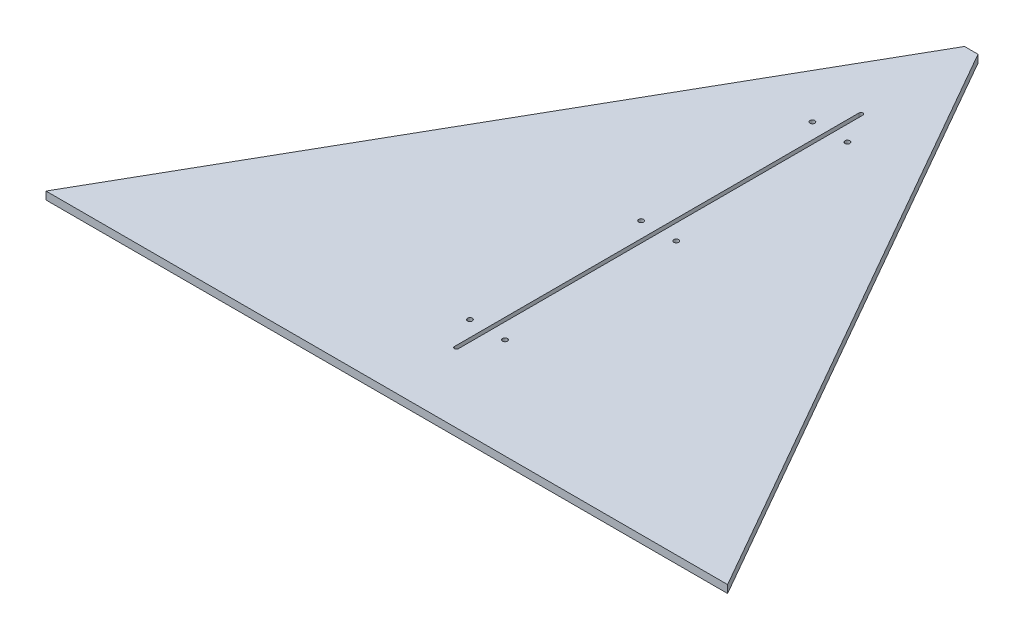
ISO-10303-21;
HEADER;
FILE_DESCRIPTION(('STEP AP214'),'2;1');
FILE_NAME('part.step','',(''),(''),'','','');
FILE_SCHEMA(('AUTOMOTIVE_DESIGN { 1 0 10303 214 1 1 1 1 }'));
ENDSEC;
DATA;
#1=APPLICATION_CONTEXT('core data for automotive mechanical design processes');
#2=APPLICATION_PROTOCOL_DEFINITION('international standard','automotive_design',2000,#1);
#3=PRODUCT_CONTEXT('',#1,'mechanical');
#4=PRODUCT('Part','Part','',(#3));
#5=PRODUCT_RELATED_PRODUCT_CATEGORY('part','',(#4));
#6=PRODUCT_DEFINITION_FORMATION('','',#4);
#7=PRODUCT_DEFINITION_CONTEXT('part definition',#1,'design');
#8=PRODUCT_DEFINITION('design','',#6,#7);
#9=PRODUCT_DEFINITION_SHAPE('','',#8);
#10=(LENGTH_UNIT() NAMED_UNIT(*) SI_UNIT(.MILLI.,.METRE.));
#11=(NAMED_UNIT(*) PLANE_ANGLE_UNIT() SI_UNIT($,.RADIAN.));
#12=(NAMED_UNIT(*) SI_UNIT($,.STERADIAN.) SOLID_ANGLE_UNIT());
#13=UNCERTAINTY_MEASURE_WITH_UNIT(LENGTH_MEASURE(1.E-05),#10,'distance_accuracy_value','');
#14=(GEOMETRIC_REPRESENTATION_CONTEXT(3) GLOBAL_UNCERTAINTY_ASSIGNED_CONTEXT((#13)) GLOBAL_UNIT_ASSIGNED_CONTEXT((#10,
#11,#12)) REPRESENTATION_CONTEXT('',''));
#15=CARTESIAN_POINT('',(0.,0.,0.));
#16=DIRECTION('',(0.,0.,1.));
#17=DIRECTION('',(1.,0.,0.));
#18=AXIS2_PLACEMENT_3D('',#15,#16,#17);
#19=CARTESIAN_POINT('',(0.,12.7,0.));
#20=DIRECTION('',(0.,1.,0.));
#21=DIRECTION('',(0.,0.,1.));
#22=AXIS2_PLACEMENT_3D('',#19,#20,#21);
#23=PLANE('',#22);
#24=DIRECTION('',(0.,0.,-1.));
#25=VECTOR('',#24,1.);
#26=CARTESIAN_POINT('',(3.175,12.7,840.296899338832));
#27=LINE('',#26,#25);
#28=CARTESIAN_POINT('',(3.175,12.7,179.89689933873));
#29=VERTEX_POINT('',#28);
#30=CARTESIAN_POINT('',(3.175,12.7,840.296899338832));
#31=VERTEX_POINT('',#30);
#32=EDGE_CURVE('E112',#29,#31,#27,.F.);
#33=ORIENTED_EDGE('',*,*,#32,.T.);
#34=CARTESIAN_POINT('',(0.,12.7,840.296899338832));
#35=DIRECTION('',(0.,1.,0.));
#36=DIRECTION('',(0.,0.,1.));
#37=AXIS2_PLACEMENT_3D('',#34,#35,#36);
#38=CIRCLE('',#37,3.175);
#39=CARTESIAN_POINT('',(-3.175,12.7,840.296899338832));
#40=VERTEX_POINT('',#39);
#41=EDGE_CURVE('E59',#31,#40,#38,.F.);
#42=ORIENTED_EDGE('',*,*,#41,.T.);
#43=DIRECTION('',(0.,0.,1.));
#44=VECTOR('',#43,1.);
#45=CARTESIAN_POINT('',(-3.175,12.7,179.89689933873));
#46=LINE('',#45,#44);
#47=CARTESIAN_POINT('',(-3.175,12.7,179.89689933873));
#48=VERTEX_POINT('',#47);
#49=EDGE_CURVE('E116',#40,#48,#46,.F.);
#50=ORIENTED_EDGE('',*,*,#49,.T.);
#51=CARTESIAN_POINT('',(0.,12.7,179.89689933873));
#52=DIRECTION('',(0.,1.,0.));
#53=DIRECTION('',(0.,0.,1.));
#54=AXIS2_PLACEMENT_3D('',#51,#52,#53);
#55=CIRCLE('',#54,3.175);
#56=EDGE_CURVE('E145',#48,#29,#55,.F.);
#57=ORIENTED_EDGE('',*,*,#56,.T.);
#58=EDGE_LOOP('',(#33,#42,#50,#57));
#59=FACE_BOUND('',#58,.T.);
#60=CARTESIAN_POINT('',(-28.575,12.7,789.496899338832));
#61=DIRECTION('',(0.,1.,0.));
#62=DIRECTION('',(0.,0.,1.));
#63=AXIS2_PLACEMENT_3D('',#60,#61,#62);
#64=CIRCLE('',#63,3.96875);
#65=CARTESIAN_POINT('',(-28.575,12.7,793.465649338832));
#66=VERTEX_POINT('',#65);
#67=EDGE_CURVE('E148',#66,#66,#64,.F.);
#68=ORIENTED_EDGE('',*,*,#67,.T.);
#69=EDGE_LOOP('',(#68));
#70=FACE_BOUND('',#69,.T.);
#71=CARTESIAN_POINT('',(28.575,12.7,789.496899338832));
#72=DIRECTION('',(0.,1.,0.));
#73=DIRECTION('',(0.,0.,1.));
#74=AXIS2_PLACEMENT_3D('',#71,#72,#73);
#75=CIRCLE('',#74,3.96875);
#76=CARTESIAN_POINT('',(28.575,12.7,793.465649338832));
#77=VERTEX_POINT('',#76);
#78=EDGE_CURVE('E151',#77,#77,#75,.F.);
#79=ORIENTED_EDGE('',*,*,#78,.T.);
#80=EDGE_LOOP('',(#79));
#81=FACE_BOUND('',#80,.T.);
#82=CARTESIAN_POINT('',(28.575,12.7,510.096899338832));
#83=DIRECTION('',(0.,1.,0.));
#84=DIRECTION('',(0.,0.,1.));
#85=AXIS2_PLACEMENT_3D('',#82,#83,#84);
#86=CIRCLE('',#85,3.96875);
#87=CARTESIAN_POINT('',(28.575,12.7,514.065649338832));
#88=VERTEX_POINT('',#87);
#89=EDGE_CURVE('E154',#88,#88,#86,.F.);
#90=ORIENTED_EDGE('',*,*,#89,.T.);
#91=EDGE_LOOP('',(#90));
#92=FACE_BOUND('',#91,.T.);
#93=CARTESIAN_POINT('',(-28.575,12.7,510.096899338832));
#94=DIRECTION('',(0.,1.,0.));
#95=DIRECTION('',(0.,0.,1.));
#96=AXIS2_PLACEMENT_3D('',#93,#94,#95);
#97=CIRCLE('',#96,3.96875);
#98=CARTESIAN_POINT('',(-28.575,12.7,514.065649338832));
#99=VERTEX_POINT('',#98);
#100=EDGE_CURVE('E157',#99,#99,#97,.F.);
#101=ORIENTED_EDGE('',*,*,#100,.T.);
#102=EDGE_LOOP('',(#101));
#103=FACE_BOUND('',#102,.T.);
#104=CARTESIAN_POINT('',(28.575,12.7,230.69689933873));
#105=DIRECTION('',(0.,1.,0.));
#106=DIRECTION('',(0.,0.,1.));
#107=AXIS2_PLACEMENT_3D('',#104,#105,#106);
#108=CIRCLE('',#107,3.96875);
#109=CARTESIAN_POINT('',(28.575,12.7,234.66564933873));
#110=VERTEX_POINT('',#109);
#111=EDGE_CURVE('E159',#110,#110,#108,.F.);
#112=ORIENTED_EDGE('',*,*,#111,.T.);
#113=EDGE_LOOP('',(#112));
#114=FACE_BOUND('',#113,.T.);
#115=CARTESIAN_POINT('',(-28.575,12.7,230.69689933873));
#116=DIRECTION('',(0.,1.,0.));
#117=DIRECTION('',(0.,0.,1.));
#118=AXIS2_PLACEMENT_3D('',#115,#116,#117);
#119=CIRCLE('',#118,3.96875);
#120=CARTESIAN_POINT('',(-28.575,12.7,234.66564933873));
#121=VERTEX_POINT('',#120);
#122=EDGE_CURVE('E20',#121,#121,#119,.F.);
#123=ORIENTED_EDGE('',*,*,#122,.T.);
#124=EDGE_LOOP('',(#123));
#125=FACE_BOUND('',#124,.T.);
#126=DIRECTION('',(-1.,0.,0.));
#127=VECTOR('',#126,1.);
#128=CARTESIAN_POINT('',(10.9982,12.7,0.));
#129=LINE('',#128,#127);
#130=CARTESIAN_POINT('',(-10.9982,12.7,0.));
#131=VERTEX_POINT('',#130);
#132=CARTESIAN_POINT('',(10.9981999999954,12.7,2.58126853225349E-12));
#133=VERTEX_POINT('',#132);
#134=EDGE_CURVE('E102',#131,#133,#129,.F.);
#135=ORIENTED_EDGE('',*,*,#134,.F.);
#136=DIRECTION('',(-0.49623121387281,0.,0.868190406753218));
#137=VECTOR('',#136,1.);
#138=CARTESIAN_POINT('',(-10.9982,12.7,0.));
#139=LINE('',#138,#137);
#140=CARTESIAN_POINT('',(-556.133000000004,12.7,953.750571338829));
#141=VERTEX_POINT('',#140);
#142=EDGE_CURVE('E99',#141,#131,#139,.F.);
#143=ORIENTED_EDGE('',*,*,#142,.F.);
#144=DIRECTION('',(1.,0.,0.));
#145=VECTOR('',#144,1.);
#146=CARTESIAN_POINT('',(-556.133,12.7,953.750571338832));
#147=LINE('',#146,#145);
#148=CARTESIAN_POINT('',(556.133,12.7,953.750571338832));
#149=VERTEX_POINT('',#148);
#150=EDGE_CURVE('E89',#149,#141,#147,.F.);
#151=ORIENTED_EDGE('',*,*,#150,.F.);
#152=DIRECTION('',(-0.49623121387281,0.,-0.868190406753218));
#153=VECTOR('',#152,1.);
#154=CARTESIAN_POINT('',(556.133,12.7,953.750571338832));
#155=LINE('',#154,#153);
#156=EDGE_CURVE('E107',#133,#149,#155,.F.);
#157=ORIENTED_EDGE('',*,*,#156,.F.);
#158=EDGE_LOOP('',(#135,#143,#151,#157));
#159=FACE_BOUND('',#158,.T.);
#160=ADVANCED_FACE('F17',(#59,#70,#81,#92,#103,#114,#125,#159),#23,.T.);
#161=CARTESIAN_POINT('',(-10.9982,0.,0.));
#162=DIRECTION('',(-0.868190406753218,0.,-0.49623121387281));
#163=DIRECTION('',(-0.49623121387281,0.,0.868190406753218));
#164=AXIS2_PLACEMENT_3D('',#161,#162,#163);
#165=PLANE('',#164);
#166=DIRECTION('',(0.,1.,0.));
#167=VECTOR('',#166,1.);
#168=CARTESIAN_POINT('',(-10.9982,0.,0.));
#169=LINE('',#168,#167);
#170=CARTESIAN_POINT('',(-10.9982,0.,0.));
#171=VERTEX_POINT('',#170);
#172=EDGE_CURVE('E172',#171,#131,#169,.T.);
#173=ORIENTED_EDGE('',*,*,#172,.F.);
#174=DIRECTION('',(-0.496231213872794,0.,0.868190406753227));
#175=VECTOR('',#174,1.);
#176=CARTESIAN_POINT('',(-10.9982,0.,0.));
#177=LINE('',#176,#175);
#178=CARTESIAN_POINT('',(-556.133000000009,0.,953.750571338827));
#179=VERTEX_POINT('',#178);
#180=EDGE_CURVE('E68',#171,#179,#177,.T.);
#181=ORIENTED_EDGE('',*,*,#180,.T.);
#182=DIRECTION('',(0.,1.,0.));
#183=VECTOR('',#182,1.);
#184=CARTESIAN_POINT('',(-556.133,0.,953.750571338832));
#185=LINE('',#184,#183);
#186=EDGE_CURVE('E94',#141,#179,#185,.F.);
#187=ORIENTED_EDGE('',*,*,#186,.F.);
#188=ORIENTED_EDGE('',*,*,#142,.T.);
#189=EDGE_LOOP('',(#173,#181,#187,#188));
#190=FACE_BOUND('',#189,.T.);
#191=ADVANCED_FACE('F106',(#190),#165,.T.);
#192=CARTESIAN_POINT('',(-556.133,0.,953.750571338832));
#193=DIRECTION('',(0.,0.,1.));
#194=DIRECTION('',(1.,0.,0.));
#195=AXIS2_PLACEMENT_3D('',#192,#193,#194);
#196=PLANE('',#195);
#197=ORIENTED_EDGE('',*,*,#186,.T.);
#198=DIRECTION('',(1.,0.,0.));
#199=VECTOR('',#198,1.);
#200=CARTESIAN_POINT('',(0.,0.,953.750571338832));
#201=LINE('',#200,#199);
#202=CARTESIAN_POINT('',(556.133,0.,953.750571338832));
#203=VERTEX_POINT('',#202);
#204=EDGE_CURVE('E183',#179,#203,#201,.T.);
#205=ORIENTED_EDGE('',*,*,#204,.T.);
#206=DIRECTION('',(0.,1.,0.));
#207=VECTOR('',#206,1.);
#208=CARTESIAN_POINT('',(556.133,0.,953.750571338832));
#209=LINE('',#208,#207);
#210=EDGE_CURVE('E96',#149,#203,#209,.F.);
#211=ORIENTED_EDGE('',*,*,#210,.F.);
#212=ORIENTED_EDGE('',*,*,#150,.T.);
#213=EDGE_LOOP('',(#197,#205,#211,#212));
#214=FACE_BOUND('',#213,.T.);
#215=ADVANCED_FACE('F91',(#214),#196,.T.);
#216=CARTESIAN_POINT('',(556.133,0.,953.750571338832));
#217=DIRECTION('',(0.868190406753218,0.,-0.49623121387281));
#218=DIRECTION('',(-0.49623121387281,0.,-0.868190406753218));
#219=AXIS2_PLACEMENT_3D('',#216,#217,#218);
#220=PLANE('',#219);
#221=ORIENTED_EDGE('',*,*,#210,.T.);
#222=DIRECTION('',(-0.496231213872794,0.,-0.868190406753227));
#223=VECTOR('',#222,1.);
#224=CARTESIAN_POINT('',(556.133,0.,953.750571338832));
#225=LINE('',#224,#223);
#226=CARTESIAN_POINT('',(10.9981999999909,0.,5.24580379135386E-12));
#227=VERTEX_POINT('',#226);
#228=EDGE_CURVE('E181',#203,#227,#225,.T.);
#229=ORIENTED_EDGE('',*,*,#228,.T.);
#230=DIRECTION('',(0.,1.,0.));
#231=VECTOR('',#230,1.);
#232=CARTESIAN_POINT('',(10.9982,0.,0.));
#233=LINE('',#232,#231);
#234=EDGE_CURVE('E164',#133,#227,#233,.F.);
#235=ORIENTED_EDGE('',*,*,#234,.F.);
#236=ORIENTED_EDGE('',*,*,#156,.T.);
#237=EDGE_LOOP('',(#221,#229,#235,#236));
#238=FACE_BOUND('',#237,.T.);
#239=ADVANCED_FACE('F180',(#238),#220,.T.);
#240=CARTESIAN_POINT('',(10.9982,0.,0.));
#241=DIRECTION('',(0.,0.,-1.));
#242=DIRECTION('',(-1.,0.,0.));
#243=AXIS2_PLACEMENT_3D('',#240,#241,#242);
#244=PLANE('',#243);
#245=ORIENTED_EDGE('',*,*,#234,.T.);
#246=DIRECTION('',(1.,0.,0.));
#247=VECTOR('',#246,1.);
#248=CARTESIAN_POINT('',(0.,0.,0.));
#249=LINE('',#248,#247);
#250=EDGE_CURVE('E144',#227,#171,#249,.F.);
#251=ORIENTED_EDGE('',*,*,#250,.T.);
#252=ORIENTED_EDGE('',*,*,#172,.T.);
#253=ORIENTED_EDGE('',*,*,#134,.T.);
#254=EDGE_LOOP('',(#245,#251,#252,#253));
#255=FACE_BOUND('',#254,.T.);
#256=ADVANCED_FACE('F231',(#255),#244,.T.);
#257=CARTESIAN_POINT('',(-28.575,12.7,230.69689933873));
#258=DIRECTION('',(0.,1.,0.));
#259=DIRECTION('',(0.,0.,1.));
#260=AXIS2_PLACEMENT_3D('',#257,#258,#259);
#261=CYLINDRICAL_SURFACE('',#260,3.96875);
#262=ORIENTED_EDGE('',*,*,#122,.F.);
#263=EDGE_LOOP('',(#262));
#264=FACE_BOUND('',#263,.T.);
#265=CARTESIAN_POINT('',(-28.575,0.,230.69689933873));
#266=DIRECTION('',(0.,1.,0.));
#267=DIRECTION('',(0.,0.,1.));
#268=AXIS2_PLACEMENT_3D('',#265,#266,#267);
#269=CIRCLE('',#268,3.96875);
#270=CARTESIAN_POINT('',(-28.575,0.,234.66564933873));
#271=VERTEX_POINT('',#270);
#272=EDGE_CURVE('E141',#271,#271,#269,.F.);
#273=ORIENTED_EDGE('',*,*,#272,.T.);
#274=EDGE_LOOP('',(#273));
#275=FACE_BOUND('',#274,.T.);
#276=ADVANCED_FACE('F229',(#264,#275),#261,.F.);
#277=CARTESIAN_POINT('',(28.575,12.7,230.69689933873));
#278=DIRECTION('',(0.,1.,0.));
#279=DIRECTION('',(0.,0.,1.));
#280=AXIS2_PLACEMENT_3D('',#277,#278,#279);
#281=CYLINDRICAL_SURFACE('',#280,3.96875);
#282=ORIENTED_EDGE('',*,*,#111,.F.);
#283=EDGE_LOOP('',(#282));
#284=FACE_BOUND('',#283,.T.);
#285=CARTESIAN_POINT('',(28.575,0.,230.69689933873));
#286=DIRECTION('',(0.,1.,0.));
#287=DIRECTION('',(0.,0.,1.));
#288=AXIS2_PLACEMENT_3D('',#285,#286,#287);
#289=CIRCLE('',#288,3.96875);
#290=CARTESIAN_POINT('',(28.575,0.,234.66564933873));
#291=VERTEX_POINT('',#290);
#292=EDGE_CURVE('E138',#291,#291,#289,.F.);
#293=ORIENTED_EDGE('',*,*,#292,.T.);
#294=EDGE_LOOP('',(#293));
#295=FACE_BOUND('',#294,.T.);
#296=ADVANCED_FACE('F218',(#284,#295),#281,.F.);
#297=CARTESIAN_POINT('',(-28.575,12.7,510.096899338832));
#298=DIRECTION('',(0.,1.,0.));
#299=DIRECTION('',(0.,0.,1.));
#300=AXIS2_PLACEMENT_3D('',#297,#298,#299);
#301=CYLINDRICAL_SURFACE('',#300,3.96875);
#302=ORIENTED_EDGE('',*,*,#100,.F.);
#303=EDGE_LOOP('',(#302));
#304=FACE_BOUND('',#303,.T.);
#305=CARTESIAN_POINT('',(-28.575,0.,510.096899338832));
#306=DIRECTION('',(0.,1.,0.));
#307=DIRECTION('',(0.,0.,1.));
#308=AXIS2_PLACEMENT_3D('',#305,#306,#307);
#309=CIRCLE('',#308,3.96875);
#310=CARTESIAN_POINT('',(-28.575,0.,514.065649338832));
#311=VERTEX_POINT('',#310);
#312=EDGE_CURVE('E135',#311,#311,#309,.F.);
#313=ORIENTED_EDGE('',*,*,#312,.T.);
#314=EDGE_LOOP('',(#313));
#315=FACE_BOUND('',#314,.T.);
#316=ADVANCED_FACE('F214',(#304,#315),#301,.F.);
#317=CARTESIAN_POINT('',(28.575,12.7,510.096899338832));
#318=DIRECTION('',(0.,1.,0.));
#319=DIRECTION('',(0.,0.,1.));
#320=AXIS2_PLACEMENT_3D('',#317,#318,#319);
#321=CYLINDRICAL_SURFACE('',#320,3.96875);
#322=ORIENTED_EDGE('',*,*,#89,.F.);
#323=EDGE_LOOP('',(#322));
#324=FACE_BOUND('',#323,.T.);
#325=CARTESIAN_POINT('',(28.575,0.,510.096899338832));
#326=DIRECTION('',(0.,1.,0.));
#327=DIRECTION('',(0.,0.,1.));
#328=AXIS2_PLACEMENT_3D('',#325,#326,#327);
#329=CIRCLE('',#328,3.96875);
#330=CARTESIAN_POINT('',(28.575,0.,514.065649338832));
#331=VERTEX_POINT('',#330);
#332=EDGE_CURVE('E132',#331,#331,#329,.F.);
#333=ORIENTED_EDGE('',*,*,#332,.T.);
#334=EDGE_LOOP('',(#333));
#335=FACE_BOUND('',#334,.T.);
#336=ADVANCED_FACE('F217',(#324,#335),#321,.F.);
#337=CARTESIAN_POINT('',(28.575,12.7,789.496899338832));
#338=DIRECTION('',(0.,1.,0.));
#339=DIRECTION('',(0.,0.,1.));
#340=AXIS2_PLACEMENT_3D('',#337,#338,#339);
#341=CYLINDRICAL_SURFACE('',#340,3.96875);
#342=ORIENTED_EDGE('',*,*,#78,.F.);
#343=EDGE_LOOP('',(#342));
#344=FACE_BOUND('',#343,.T.);
#345=CARTESIAN_POINT('',(28.575,0.,789.496899338832));
#346=DIRECTION('',(0.,1.,0.));
#347=DIRECTION('',(0.,0.,1.));
#348=AXIS2_PLACEMENT_3D('',#345,#346,#347);
#349=CIRCLE('',#348,3.96875);
#350=CARTESIAN_POINT('',(28.575,0.,793.465649338832));
#351=VERTEX_POINT('',#350);
#352=EDGE_CURVE('E129',#351,#351,#349,.F.);
#353=ORIENTED_EDGE('',*,*,#352,.T.);
#354=EDGE_LOOP('',(#353));
#355=FACE_BOUND('',#354,.T.);
#356=ADVANCED_FACE('F293',(#344,#355),#341,.F.);
#357=CARTESIAN_POINT('',(-28.575,12.7,789.496899338832));
#358=DIRECTION('',(0.,1.,0.));
#359=DIRECTION('',(0.,0.,1.));
#360=AXIS2_PLACEMENT_3D('',#357,#358,#359);
#361=CYLINDRICAL_SURFACE('',#360,3.96875);
#362=ORIENTED_EDGE('',*,*,#67,.F.);
#363=EDGE_LOOP('',(#362));
#364=FACE_BOUND('',#363,.T.);
#365=CARTESIAN_POINT('',(-28.575,0.,789.496899338832));
#366=DIRECTION('',(0.,1.,0.));
#367=DIRECTION('',(0.,0.,1.));
#368=AXIS2_PLACEMENT_3D('',#365,#366,#367);
#369=CIRCLE('',#368,3.96875);
#370=CARTESIAN_POINT('',(-28.575,0.,793.465649338832));
#371=VERTEX_POINT('',#370);
#372=EDGE_CURVE('E126',#371,#371,#369,.F.);
#373=ORIENTED_EDGE('',*,*,#372,.T.);
#374=EDGE_LOOP('',(#373));
#375=FACE_BOUND('',#374,.T.);
#376=ADVANCED_FACE('F303',(#364,#375),#361,.F.);
#377=CARTESIAN_POINT('',(0.,12.7,840.296899338832));
#378=DIRECTION('',(0.,1.,0.));
#379=DIRECTION('',(0.,0.,1.));
#380=AXIS2_PLACEMENT_3D('',#377,#378,#379);
#381=CYLINDRICAL_SURFACE('',#380,3.175);
#382=ORIENTED_EDGE('',*,*,#41,.F.);
#383=DIRECTION('',(0.,1.,0.));
#384=VECTOR('',#383,1.);
#385=CARTESIAN_POINT('',(3.175,12.7,840.296899338832));
#386=LINE('',#385,#384);
#387=CARTESIAN_POINT('',(3.175,0.,840.296899338832));
#388=VERTEX_POINT('',#387);
#389=EDGE_CURVE('E115',#31,#388,#386,.F.);
#390=ORIENTED_EDGE('',*,*,#389,.T.);
#391=CARTESIAN_POINT('',(0.,0.,840.296899338832));
#392=DIRECTION('',(0.,1.,0.));
#393=DIRECTION('',(0.,0.,1.));
#394=AXIS2_PLACEMENT_3D('',#391,#392,#393);
#395=CIRCLE('',#394,3.175);
#396=CARTESIAN_POINT('',(-3.175,0.,840.296899338832));
#397=VERTEX_POINT('',#396);
#398=EDGE_CURVE('E123',#388,#397,#395,.F.);
#399=ORIENTED_EDGE('',*,*,#398,.T.);
#400=DIRECTION('',(0.,1.,0.));
#401=VECTOR('',#400,1.);
#402=CARTESIAN_POINT('',(-3.175,12.7,840.296899338832));
#403=LINE('',#402,#401);
#404=EDGE_CURVE('E119',#397,#40,#403,.T.);
#405=ORIENTED_EDGE('',*,*,#404,.T.);
#406=EDGE_LOOP('',(#382,#390,#399,#405));
#407=FACE_BOUND('',#406,.T.);
#408=ADVANCED_FACE('F313',(#407),#381,.F.);
#409=CARTESIAN_POINT('',(-3.175,12.7,179.89689933873));
#410=DIRECTION('',(-1.,0.,0.));
#411=DIRECTION('',(0.,0.,1.));
#412=AXIS2_PLACEMENT_3D('',#409,#410,#411);
#413=PLANE('',#412);
#414=ORIENTED_EDGE('',*,*,#49,.F.);
#415=ORIENTED_EDGE('',*,*,#404,.F.);
#416=DIRECTION('',(0.,0.,1.));
#417=VECTOR('',#416,1.);
#418=CARTESIAN_POINT('',(-3.175,0.,0.));
#419=LINE('',#418,#417);
#420=CARTESIAN_POINT('',(-3.175,0.,179.89689933873));
#421=VERTEX_POINT('',#420);
#422=EDGE_CURVE('E122',#397,#421,#419,.F.);
#423=ORIENTED_EDGE('',*,*,#422,.T.);
#424=DIRECTION('',(0.,1.,0.));
#425=VECTOR('',#424,1.);
#426=CARTESIAN_POINT('',(-3.175,12.7,179.89689933873));
#427=LINE('',#426,#425);
#428=EDGE_CURVE('E118',#421,#48,#427,.T.);
#429=ORIENTED_EDGE('',*,*,#428,.T.);
#430=EDGE_LOOP('',(#414,#415,#423,#429));
#431=FACE_BOUND('',#430,.T.);
#432=ADVANCED_FACE('F194',(#431),#413,.F.);
#433=CARTESIAN_POINT('',(0.,12.7,179.89689933873));
#434=DIRECTION('',(0.,1.,0.));
#435=DIRECTION('',(0.,0.,1.));
#436=AXIS2_PLACEMENT_3D('',#433,#434,#435);
#437=CYLINDRICAL_SURFACE('',#436,3.175);
#438=ORIENTED_EDGE('',*,*,#56,.F.);
#439=ORIENTED_EDGE('',*,*,#428,.F.);
#440=CARTESIAN_POINT('',(0.,0.,179.89689933873));
#441=DIRECTION('',(0.,1.,0.));
#442=DIRECTION('',(0.,0.,1.));
#443=AXIS2_PLACEMENT_3D('',#440,#441,#442);
#444=CIRCLE('',#443,3.175);
#445=CARTESIAN_POINT('',(3.175,0.,179.89689933873));
#446=VERTEX_POINT('',#445);
#447=EDGE_CURVE('E26',#421,#446,#444,.F.);
#448=ORIENTED_EDGE('',*,*,#447,.T.);
#449=DIRECTION('',(0.,1.,0.));
#450=VECTOR('',#449,1.);
#451=CARTESIAN_POINT('',(3.175,12.7,179.89689933873));
#452=LINE('',#451,#450);
#453=EDGE_CURVE('E34',#446,#29,#452,.T.);
#454=ORIENTED_EDGE('',*,*,#453,.T.);
#455=EDGE_LOOP('',(#438,#439,#448,#454));
#456=FACE_BOUND('',#455,.T.);
#457=ADVANCED_FACE('F199',(#456),#437,.F.);
#458=CARTESIAN_POINT('',(3.175,12.7,840.296899338832));
#459=DIRECTION('',(1.,0.,0.));
#460=DIRECTION('',(0.,0.,-1.));
#461=AXIS2_PLACEMENT_3D('',#458,#459,#460);
#462=PLANE('',#461);
#463=ORIENTED_EDGE('',*,*,#32,.F.);
#464=ORIENTED_EDGE('',*,*,#453,.F.);
#465=DIRECTION('',(0.,0.,1.));
#466=VECTOR('',#465,1.);
#467=CARTESIAN_POINT('',(3.175,0.,0.));
#468=LINE('',#467,#466);
#469=EDGE_CURVE('E11',#446,#388,#468,.T.);
#470=ORIENTED_EDGE('',*,*,#469,.T.);
#471=ORIENTED_EDGE('',*,*,#389,.F.);
#472=EDGE_LOOP('',(#463,#464,#470,#471));
#473=FACE_BOUND('',#472,.T.);
#474=ADVANCED_FACE('F202',(#473),#462,.F.);
#475=CARTESIAN_POINT('',(0.,0.,0.));
#476=DIRECTION('',(0.,1.,0.));
#477=DIRECTION('',(0.,0.,1.));
#478=AXIS2_PLACEMENT_3D('',#475,#476,#477);
#479=PLANE('',#478);
#480=ORIENTED_EDGE('',*,*,#447,.F.);
#481=ORIENTED_EDGE('',*,*,#422,.F.);
#482=ORIENTED_EDGE('',*,*,#398,.F.);
#483=ORIENTED_EDGE('',*,*,#469,.F.);
#484=EDGE_LOOP('',(#480,#481,#482,#483));
#485=FACE_BOUND('',#484,.T.);
#486=ORIENTED_EDGE('',*,*,#372,.F.);
#487=EDGE_LOOP('',(#486));
#488=FACE_BOUND('',#487,.T.);
#489=ORIENTED_EDGE('',*,*,#352,.F.);
#490=EDGE_LOOP('',(#489));
#491=FACE_BOUND('',#490,.T.);
#492=ORIENTED_EDGE('',*,*,#332,.F.);
#493=EDGE_LOOP('',(#492));
#494=FACE_BOUND('',#493,.T.);
#495=ORIENTED_EDGE('',*,*,#312,.F.);
#496=EDGE_LOOP('',(#495));
#497=FACE_BOUND('',#496,.T.);
#498=ORIENTED_EDGE('',*,*,#292,.F.);
#499=EDGE_LOOP('',(#498));
#500=FACE_BOUND('',#499,.T.);
#501=ORIENTED_EDGE('',*,*,#272,.F.);
#502=EDGE_LOOP('',(#501));
#503=FACE_BOUND('',#502,.T.);
#504=ORIENTED_EDGE('',*,*,#228,.F.);
#505=ORIENTED_EDGE('',*,*,#204,.F.);
#506=ORIENTED_EDGE('',*,*,#180,.F.);
#507=ORIENTED_EDGE('',*,*,#250,.F.);
#508=EDGE_LOOP('',(#504,#505,#506,#507));
#509=FACE_BOUND('',#508,.T.);
#510=ADVANCED_FACE('F182',(#485,#488,#491,#494,#497,#500,#503,#509),#479,.F.);
#511=CLOSED_SHELL('',(#160,#191,#215,#239,#256,#276,#296,#316,#336,#356,#376,#408,#432,#457,
#474,#510));
#512=MANIFOLD_SOLID_BREP('B1',#511);
#513=ADVANCED_BREP_SHAPE_REPRESENTATION('',(#18,#512),#14);
#514=SHAPE_DEFINITION_REPRESENTATION(#9,#513);
ENDSEC;
END-ISO-10303-21;
